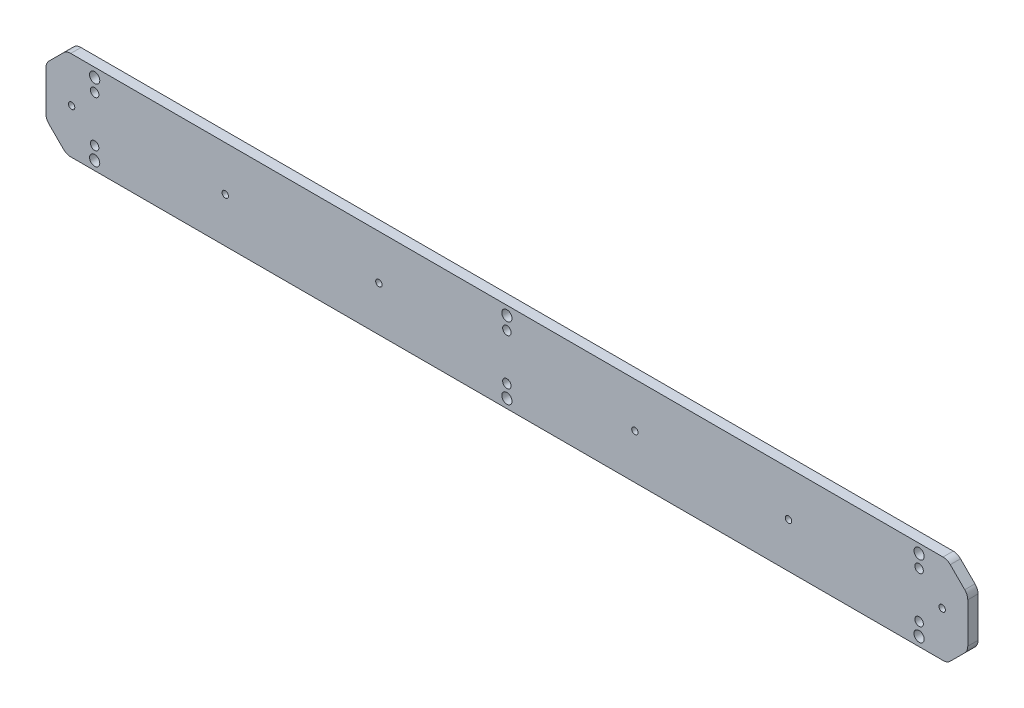
ISO-10303-21;
HEADER;
FILE_DESCRIPTION(('STEP AP214'),'2;1');
FILE_NAME('part.step','',(''),(''),'','','');
FILE_SCHEMA(('AUTOMOTIVE_DESIGN { 1 0 10303 214 1 1 1 1 }'));
ENDSEC;
DATA;
#1=APPLICATION_CONTEXT('core data for automotive mechanical design processes');
#2=APPLICATION_PROTOCOL_DEFINITION('international standard','automotive_design',2000,#1);
#3=PRODUCT_CONTEXT('',#1,'mechanical');
#4=PRODUCT('Part','Part','',(#3));
#5=PRODUCT_RELATED_PRODUCT_CATEGORY('part','',(#4));
#6=PRODUCT_DEFINITION_FORMATION('','',#4);
#7=PRODUCT_DEFINITION_CONTEXT('part definition',#1,'design');
#8=PRODUCT_DEFINITION('design','',#6,#7);
#9=PRODUCT_DEFINITION_SHAPE('','',#8);
#10=(LENGTH_UNIT() NAMED_UNIT(*) SI_UNIT(.MILLI.,.METRE.));
#11=(NAMED_UNIT(*) PLANE_ANGLE_UNIT() SI_UNIT($,.RADIAN.));
#12=(NAMED_UNIT(*) SI_UNIT($,.STERADIAN.) SOLID_ANGLE_UNIT());
#13=UNCERTAINTY_MEASURE_WITH_UNIT(LENGTH_MEASURE(1.E-05),#10,'distance_accuracy_value','');
#14=(GEOMETRIC_REPRESENTATION_CONTEXT(3) GLOBAL_UNCERTAINTY_ASSIGNED_CONTEXT((#13)) GLOBAL_UNIT_ASSIGNED_CONTEXT((#10,
#11,#12)) REPRESENTATION_CONTEXT('',''));
#15=CARTESIAN_POINT('',(0.,0.,0.));
#16=DIRECTION('',(0.,0.,1.));
#17=DIRECTION('',(1.,0.,0.));
#18=AXIS2_PLACEMENT_3D('',#15,#16,#17);
#19=CARTESIAN_POINT('',(0.,0.,0.));
#20=DIRECTION('',(0.,0.,-1.));
#21=DIRECTION('',(-1.,0.,0.));
#22=AXIS2_PLACEMENT_3D('',#19,#20,#21);
#23=PLANE('',#22);
#24=CARTESIAN_POINT('',(-170.,0.,0.));
#25=DIRECTION('',(0.,0.,1.));
#26=DIRECTION('',(1.,0.,0.));
#27=AXIS2_PLACEMENT_3D('',#24,#25,#26);
#28=CIRCLE('',#27,1.25);
#29=CARTESIAN_POINT('',(-168.75,0.,0.));
#30=VERTEX_POINT('',#29);
#31=EDGE_CURVE('E405',#30,#30,#28,.T.);
#32=ORIENTED_EDGE('',*,*,#31,.T.);
#33=EDGE_LOOP('',(#32));
#34=FACE_BOUND('',#33,.T.);
#35=CARTESIAN_POINT('',(-110.,0.,0.));
#36=DIRECTION('',(0.,0.,1.));
#37=DIRECTION('',(1.,0.,0.));
#38=AXIS2_PLACEMENT_3D('',#35,#36,#37);
#39=CIRCLE('',#38,1.25);
#40=CARTESIAN_POINT('',(-108.75,0.,0.));
#41=VERTEX_POINT('',#40);
#42=EDGE_CURVE('E399',#41,#41,#39,.T.);
#43=ORIENTED_EDGE('',*,*,#42,.T.);
#44=EDGE_LOOP('',(#43));
#45=FACE_BOUND('',#44,.T.);
#46=CARTESIAN_POINT('',(-50.,0.,0.));
#47=DIRECTION('',(0.,0.,1.));
#48=DIRECTION('',(1.,0.,0.));
#49=AXIS2_PLACEMENT_3D('',#46,#47,#48);
#50=CIRCLE('',#49,1.25);
#51=CARTESIAN_POINT('',(-48.75,0.,0.));
#52=VERTEX_POINT('',#51);
#53=EDGE_CURVE('E393',#52,#52,#50,.T.);
#54=ORIENTED_EDGE('',*,*,#53,.T.);
#55=EDGE_LOOP('',(#54));
#56=FACE_BOUND('',#55,.T.);
#57=CARTESIAN_POINT('',(50.,0.,0.));
#58=DIRECTION('',(0.,0.,1.));
#59=DIRECTION('',(1.,0.,0.));
#60=AXIS2_PLACEMENT_3D('',#57,#58,#59);
#61=CIRCLE('',#60,1.25);
#62=CARTESIAN_POINT('',(51.25,0.,0.));
#63=VERTEX_POINT('',#62);
#64=EDGE_CURVE('E387',#63,#63,#61,.T.);
#65=ORIENTED_EDGE('',*,*,#64,.T.);
#66=EDGE_LOOP('',(#65));
#67=FACE_BOUND('',#66,.T.);
#68=CARTESIAN_POINT('',(110.,0.,0.));
#69=DIRECTION('',(0.,0.,1.));
#70=DIRECTION('',(1.,0.,0.));
#71=AXIS2_PLACEMENT_3D('',#68,#69,#70);
#72=CIRCLE('',#71,1.25);
#73=CARTESIAN_POINT('',(111.25,0.,0.));
#74=VERTEX_POINT('',#73);
#75=EDGE_CURVE('E381',#74,#74,#72,.T.);
#76=ORIENTED_EDGE('',*,*,#75,.T.);
#77=EDGE_LOOP('',(#76));
#78=FACE_BOUND('',#77,.T.);
#79=CARTESIAN_POINT('',(170.,0.,0.));
#80=DIRECTION('',(0.,0.,1.));
#81=DIRECTION('',(1.,0.,0.));
#82=AXIS2_PLACEMENT_3D('',#79,#80,#81);
#83=CIRCLE('',#82,1.25);
#84=CARTESIAN_POINT('',(171.25,0.,0.));
#85=VERTEX_POINT('',#84);
#86=EDGE_CURVE('E375',#85,#85,#83,.T.);
#87=ORIENTED_EDGE('',*,*,#86,.T.);
#88=EDGE_LOOP('',(#87));
#89=FACE_BOUND('',#88,.T.);
#90=CARTESIAN_POINT('',(0.,9.,0.));
#91=DIRECTION('',(0.,0.,1.));
#92=DIRECTION('',(1.,0.,0.));
#93=AXIS2_PLACEMENT_3D('',#90,#91,#92);
#94=CIRCLE('',#93,1.65);
#95=CARTESIAN_POINT('',(1.65,9.,0.));
#96=VERTEX_POINT('',#95);
#97=EDGE_CURVE('E357',#96,#96,#94,.T.);
#98=ORIENTED_EDGE('',*,*,#97,.T.);
#99=EDGE_LOOP('',(#98));
#100=FACE_BOUND('',#99,.T.);
#101=CARTESIAN_POINT('',(0.,-9.,0.));
#102=DIRECTION('',(0.,0.,1.));
#103=DIRECTION('',(1.,0.,0.));
#104=AXIS2_PLACEMENT_3D('',#101,#102,#103);
#105=CIRCLE('',#104,1.65);
#106=CARTESIAN_POINT('',(1.65,-9.,0.));
#107=VERTEX_POINT('',#106);
#108=EDGE_CURVE('E351',#107,#107,#105,.T.);
#109=ORIENTED_EDGE('',*,*,#108,.T.);
#110=EDGE_LOOP('',(#109));
#111=FACE_BOUND('',#110,.T.);
#112=DIRECTION('',(1.,0.,0.));
#113=VECTOR('',#112,1.);
#114=CARTESIAN_POINT('',(-180.,-17.5,0.));
#115=LINE('',#114,#113);
#116=CARTESIAN_POINT('',(-170.343145750508,-17.5,0.));
#117=VERTEX_POINT('',#116);
#118=CARTESIAN_POINT('',(170.343145750507,-17.5,0.));
#119=VERTEX_POINT('',#118);
#120=EDGE_CURVE('E181',#117,#119,#115,.T.);
#121=ORIENTED_EDGE('',*,*,#120,.F.);
#122=CARTESIAN_POINT('',(-170.343145750508,-13.5,0.));
#123=DIRECTION('',(0.,0.,-1.));
#124=DIRECTION('',(-1.,0.,0.));
#125=AXIS2_PLACEMENT_3D('',#122,#123,#124);
#126=CIRCLE('',#125,4.);
#127=CARTESIAN_POINT('',(-173.171572875254,-16.3284271247462,0.));
#128=VERTEX_POINT('',#127);
#129=EDGE_CURVE('E163',#117,#128,#126,.T.);
#130=ORIENTED_EDGE('',*,*,#129,.T.);
#131=DIRECTION('',(0.707106781186548,-0.707106781186548,0.));
#132=VECTOR('',#131,1.);
#133=CARTESIAN_POINT('',(-94.75,-94.75,0.));
#134=LINE('',#133,#132);
#135=CARTESIAN_POINT('',(-178.828427124746,-10.6715728752538,0.));
#136=VERTEX_POINT('',#135);
#137=EDGE_CURVE('E231',#128,#136,#134,.F.);
#138=ORIENTED_EDGE('',*,*,#137,.T.);
#139=CARTESIAN_POINT('',(-176.,-7.84314575050758,0.));
#140=DIRECTION('',(0.,0.,-1.));
#141=DIRECTION('',(-1.,0.,0.));
#142=AXIS2_PLACEMENT_3D('',#139,#140,#141);
#143=CIRCLE('',#142,4.);
#144=CARTESIAN_POINT('',(-180.,-7.84314575050758,0.));
#145=VERTEX_POINT('',#144);
#146=EDGE_CURVE('E174',#136,#145,#143,.T.);
#147=ORIENTED_EDGE('',*,*,#146,.T.);
#148=DIRECTION('',(0.,-1.,0.));
#149=VECTOR('',#148,1.);
#150=CARTESIAN_POINT('',(-180.,-17.5,0.));
#151=LINE('',#150,#149);
#152=CARTESIAN_POINT('',(-180.,7.84314575050757,0.));
#153=VERTEX_POINT('',#152);
#154=EDGE_CURVE('E193',#153,#145,#151,.T.);
#155=ORIENTED_EDGE('',*,*,#154,.F.);
#156=CARTESIAN_POINT('',(-176.,7.84314575050757,0.));
#157=DIRECTION('',(0.,0.,-1.));
#158=DIRECTION('',(-1.,0.,0.));
#159=AXIS2_PLACEMENT_3D('',#156,#157,#158);
#160=CIRCLE('',#159,4.);
#161=CARTESIAN_POINT('',(-178.828427124746,10.6715728752538,0.));
#162=VERTEX_POINT('',#161);
#163=EDGE_CURVE('E258',#153,#162,#160,.T.);
#164=ORIENTED_EDGE('',*,*,#163,.T.);
#165=DIRECTION('',(-0.707106781186548,-0.707106781186548,0.));
#166=VECTOR('',#165,1.);
#167=CARTESIAN_POINT('',(-94.75,94.75,0.));
#168=LINE('',#167,#166);
#169=CARTESIAN_POINT('',(-173.171572875254,16.3284271247462,0.));
#170=VERTEX_POINT('',#169);
#171=EDGE_CURVE('E228',#162,#170,#168,.F.);
#172=ORIENTED_EDGE('',*,*,#171,.T.);
#173=CARTESIAN_POINT('',(-170.343145750508,13.5,0.));
#174=DIRECTION('',(0.,0.,-1.));
#175=DIRECTION('',(-1.,0.,0.));
#176=AXIS2_PLACEMENT_3D('',#173,#174,#175);
#177=CIRCLE('',#176,4.);
#178=CARTESIAN_POINT('',(-170.343145750508,17.5,0.));
#179=VERTEX_POINT('',#178);
#180=EDGE_CURVE('E256',#170,#179,#177,.T.);
#181=ORIENTED_EDGE('',*,*,#180,.T.);
#182=DIRECTION('',(-1.,0.,0.));
#183=VECTOR('',#182,1.);
#184=CARTESIAN_POINT('',(-180.,17.5,0.));
#185=LINE('',#184,#183);
#186=CARTESIAN_POINT('',(170.343145750507,17.5,0.));
#187=VERTEX_POINT('',#186);
#188=EDGE_CURVE('E199',#187,#179,#185,.T.);
#189=ORIENTED_EDGE('',*,*,#188,.F.);
#190=CARTESIAN_POINT('',(170.343145750508,13.5,0.));
#191=DIRECTION('',(0.,0.,-1.));
#192=DIRECTION('',(-1.,0.,0.));
#193=AXIS2_PLACEMENT_3D('',#190,#191,#192);
#194=CIRCLE('',#193,4.);
#195=CARTESIAN_POINT('',(173.171572875254,16.3284271247462,0.));
#196=VERTEX_POINT('',#195);
#197=EDGE_CURVE('E185',#187,#196,#194,.T.);
#198=ORIENTED_EDGE('',*,*,#197,.T.);
#199=DIRECTION('',(-0.707106781186548,0.707106781186548,0.));
#200=VECTOR('',#199,1.);
#201=CARTESIAN_POINT('',(94.75,94.75,0.));
#202=LINE('',#201,#200);
#203=CARTESIAN_POINT('',(178.828427124746,10.6715728752538,0.));
#204=VERTEX_POINT('',#203);
#205=EDGE_CURVE('E233',#196,#204,#202,.F.);
#206=ORIENTED_EDGE('',*,*,#205,.T.);
#207=CARTESIAN_POINT('',(176.,7.84314575050757,0.));
#208=DIRECTION('',(0.,0.,-1.));
#209=DIRECTION('',(-1.,0.,0.));
#210=AXIS2_PLACEMENT_3D('',#207,#208,#209);
#211=CIRCLE('',#210,4.);
#212=CARTESIAN_POINT('',(180.,7.84314575050757,0.));
#213=VERTEX_POINT('',#212);
#214=EDGE_CURVE('E251',#204,#213,#211,.T.);
#215=ORIENTED_EDGE('',*,*,#214,.T.);
#216=DIRECTION('',(0.,1.,0.));
#217=VECTOR('',#216,1.);
#218=CARTESIAN_POINT('',(180.,-17.5,0.));
#219=LINE('',#218,#217);
#220=CARTESIAN_POINT('',(180.,-7.84314575050758,0.));
#221=VERTEX_POINT('',#220);
#222=EDGE_CURVE('E206',#221,#213,#219,.T.);
#223=ORIENTED_EDGE('',*,*,#222,.F.);
#224=CARTESIAN_POINT('',(176.,-7.84314575050758,0.));
#225=DIRECTION('',(0.,0.,-1.));
#226=DIRECTION('',(-1.,0.,0.));
#227=AXIS2_PLACEMENT_3D('',#224,#225,#226);
#228=CIRCLE('',#227,4.);
#229=CARTESIAN_POINT('',(178.828427124746,-10.6715728752538,0.));
#230=VERTEX_POINT('',#229);
#231=EDGE_CURVE('E253',#221,#230,#228,.T.);
#232=ORIENTED_EDGE('',*,*,#231,.T.);
#233=DIRECTION('',(0.707106781186548,0.707106781186548,0.));
#234=VECTOR('',#233,1.);
#235=CARTESIAN_POINT('',(94.75,-94.75,0.));
#236=LINE('',#235,#234);
#237=CARTESIAN_POINT('',(173.171572875254,-16.3284271247462,0.));
#238=VERTEX_POINT('',#237);
#239=EDGE_CURVE('E236',#230,#238,#236,.F.);
#240=ORIENTED_EDGE('',*,*,#239,.T.);
#241=CARTESIAN_POINT('',(170.343145750508,-13.5,0.));
#242=DIRECTION('',(0.,0.,-1.));
#243=DIRECTION('',(-1.,0.,0.));
#244=AXIS2_PLACEMENT_3D('',#241,#242,#243);
#245=CIRCLE('',#244,4.);
#246=EDGE_CURVE('E191',#238,#119,#245,.T.);
#247=ORIENTED_EDGE('',*,*,#246,.T.);
#248=EDGE_LOOP('',(#121,#130,#138,#147,#155,#164,#172,#181,#189,#198,#206,#215,#223,#232,#240,#247));
#249=FACE_BOUND('',#248,.T.);
#250=CARTESIAN_POINT('',(0.,14.,0.));
#251=DIRECTION('',(0.,0.,-1.));
#252=DIRECTION('',(-1.,0.,0.));
#253=AXIS2_PLACEMENT_3D('',#250,#251,#252);
#254=CIRCLE('',#253,2.);
#255=CARTESIAN_POINT('',(-2.,14.,0.));
#256=VERTEX_POINT('',#255);
#257=EDGE_CURVE('E203',#256,#256,#254,.T.);
#258=ORIENTED_EDGE('',*,*,#257,.F.);
#259=EDGE_LOOP('',(#258));
#260=FACE_BOUND('',#259,.T.);
#261=CARTESIAN_POINT('',(0.,-14.,0.));
#262=DIRECTION('',(0.,0.,-1.));
#263=DIRECTION('',(-1.,0.,0.));
#264=AXIS2_PLACEMENT_3D('',#261,#262,#263);
#265=CIRCLE('',#264,2.);
#266=CARTESIAN_POINT('',(-2.,-14.,0.));
#267=VERTEX_POINT('',#266);
#268=EDGE_CURVE('E208',#267,#267,#265,.T.);
#269=ORIENTED_EDGE('',*,*,#268,.F.);
#270=EDGE_LOOP('',(#269));
#271=FACE_BOUND('',#270,.T.);
#272=CARTESIAN_POINT('',(161.,14.,0.));
#273=DIRECTION('',(0.,0.,-1.));
#274=DIRECTION('',(-1.,0.,0.));
#275=AXIS2_PLACEMENT_3D('',#272,#273,#274);
#276=CIRCLE('',#275,2.);
#277=CARTESIAN_POINT('',(159.,14.,0.));
#278=VERTEX_POINT('',#277);
#279=EDGE_CURVE('E212',#278,#278,#276,.T.);
#280=ORIENTED_EDGE('',*,*,#279,.F.);
#281=EDGE_LOOP('',(#280));
#282=FACE_BOUND('',#281,.T.);
#283=CARTESIAN_POINT('',(161.,-14.,0.));
#284=DIRECTION('',(0.,0.,-1.));
#285=DIRECTION('',(-1.,0.,0.));
#286=AXIS2_PLACEMENT_3D('',#283,#284,#285);
#287=CIRCLE('',#286,2.);
#288=CARTESIAN_POINT('',(159.,-14.,0.));
#289=VERTEX_POINT('',#288);
#290=EDGE_CURVE('E216',#289,#289,#287,.T.);
#291=ORIENTED_EDGE('',*,*,#290,.F.);
#292=EDGE_LOOP('',(#291));
#293=FACE_BOUND('',#292,.T.);
#294=CARTESIAN_POINT('',(-161.,14.,0.));
#295=DIRECTION('',(0.,0.,-1.));
#296=DIRECTION('',(-1.,0.,0.));
#297=AXIS2_PLACEMENT_3D('',#294,#295,#296);
#298=CIRCLE('',#297,2.);
#299=CARTESIAN_POINT('',(-163.,14.,0.));
#300=VERTEX_POINT('',#299);
#301=EDGE_CURVE('E220',#300,#300,#298,.T.);
#302=ORIENTED_EDGE('',*,*,#301,.F.);
#303=EDGE_LOOP('',(#302));
#304=FACE_BOUND('',#303,.T.);
#305=CARTESIAN_POINT('',(-161.,-14.,0.));
#306=DIRECTION('',(0.,0.,-1.));
#307=DIRECTION('',(-1.,0.,0.));
#308=AXIS2_PLACEMENT_3D('',#305,#306,#307);
#309=CIRCLE('',#308,2.);
#310=CARTESIAN_POINT('',(-163.,-14.,0.));
#311=VERTEX_POINT('',#310);
#312=EDGE_CURVE('E224',#311,#311,#309,.T.);
#313=ORIENTED_EDGE('',*,*,#312,.F.);
#314=EDGE_LOOP('',(#313));
#315=FACE_BOUND('',#314,.T.);
#316=CARTESIAN_POINT('',(161.,-9.,0.));
#317=DIRECTION('',(0.,0.,1.));
#318=DIRECTION('',(1.,0.,0.));
#319=AXIS2_PLACEMENT_3D('',#316,#317,#318);
#320=CIRCLE('',#319,1.65000000000001);
#321=CARTESIAN_POINT('',(162.65,-9.,0.));
#322=VERTEX_POINT('',#321);
#323=EDGE_CURVE('E339',#322,#322,#320,.T.);
#324=ORIENTED_EDGE('',*,*,#323,.T.);
#325=EDGE_LOOP('',(#324));
#326=FACE_BOUND('',#325,.T.);
#327=CARTESIAN_POINT('',(161.,9.,0.));
#328=DIRECTION('',(0.,0.,1.));
#329=DIRECTION('',(1.,0.,0.));
#330=AXIS2_PLACEMENT_3D('',#327,#328,#329);
#331=CIRCLE('',#330,1.65000000000001);
#332=CARTESIAN_POINT('',(162.65,9.,0.));
#333=VERTEX_POINT('',#332);
#334=EDGE_CURVE('E345',#333,#333,#331,.T.);
#335=ORIENTED_EDGE('',*,*,#334,.T.);
#336=EDGE_LOOP('',(#335));
#337=FACE_BOUND('',#336,.T.);
#338=CARTESIAN_POINT('',(-161.,-9.,0.));
#339=DIRECTION('',(0.,0.,1.));
#340=DIRECTION('',(1.,0.,0.));
#341=AXIS2_PLACEMENT_3D('',#338,#339,#340);
#342=CIRCLE('',#341,1.65000000000001);
#343=CARTESIAN_POINT('',(-159.35,-9.,0.));
#344=VERTEX_POINT('',#343);
#345=EDGE_CURVE('E363',#344,#344,#342,.T.);
#346=ORIENTED_EDGE('',*,*,#345,.T.);
#347=EDGE_LOOP('',(#346));
#348=FACE_BOUND('',#347,.T.);
#349=CARTESIAN_POINT('',(-161.,9.,0.));
#350=DIRECTION('',(0.,0.,1.));
#351=DIRECTION('',(1.,0.,0.));
#352=AXIS2_PLACEMENT_3D('',#349,#350,#351);
#353=CIRCLE('',#352,1.65000000000001);
#354=CARTESIAN_POINT('',(-159.35,9.,0.));
#355=VERTEX_POINT('',#354);
#356=EDGE_CURVE('E369',#355,#355,#353,.T.);
#357=ORIENTED_EDGE('',*,*,#356,.T.);
#358=EDGE_LOOP('',(#357));
#359=FACE_BOUND('',#358,.T.);
#360=ADVANCED_FACE('F48',(#34,#45,#56,#67,#78,#89,#100,#111,#249,#260,#271,#282,#293,#304,#315,
#326,#337,#348,#359),#23,.T.);
#361=CARTESIAN_POINT('',(0.,0.,4.));
#362=DIRECTION('',(0.,0.,-1.));
#363=DIRECTION('',(-1.,0.,0.));
#364=AXIS2_PLACEMENT_3D('',#361,#362,#363);
#365=PLANE('',#364);
#366=CARTESIAN_POINT('',(-170.,0.,4.));
#367=DIRECTION('',(0.,0.,1.));
#368=DIRECTION('',(1.,0.,0.));
#369=AXIS2_PLACEMENT_3D('',#366,#367,#368);
#370=CIRCLE('',#369,1.25);
#371=CARTESIAN_POINT('',(-168.75,0.,4.));
#372=VERTEX_POINT('',#371);
#373=EDGE_CURVE('E408',#372,#372,#370,.T.);
#374=ORIENTED_EDGE('',*,*,#373,.F.);
#375=EDGE_LOOP('',(#374));
#376=FACE_BOUND('',#375,.T.);
#377=CARTESIAN_POINT('',(-110.,0.,4.));
#378=DIRECTION('',(0.,0.,1.));
#379=DIRECTION('',(1.,0.,0.));
#380=AXIS2_PLACEMENT_3D('',#377,#378,#379);
#381=CIRCLE('',#380,1.25);
#382=CARTESIAN_POINT('',(-108.75,0.,4.));
#383=VERTEX_POINT('',#382);
#384=EDGE_CURVE('E402',#383,#383,#381,.T.);
#385=ORIENTED_EDGE('',*,*,#384,.F.);
#386=EDGE_LOOP('',(#385));
#387=FACE_BOUND('',#386,.T.);
#388=CARTESIAN_POINT('',(-50.,0.,4.));
#389=DIRECTION('',(0.,0.,1.));
#390=DIRECTION('',(1.,0.,0.));
#391=AXIS2_PLACEMENT_3D('',#388,#389,#390);
#392=CIRCLE('',#391,1.25);
#393=CARTESIAN_POINT('',(-48.75,0.,4.));
#394=VERTEX_POINT('',#393);
#395=EDGE_CURVE('E396',#394,#394,#392,.T.);
#396=ORIENTED_EDGE('',*,*,#395,.F.);
#397=EDGE_LOOP('',(#396));
#398=FACE_BOUND('',#397,.T.);
#399=CARTESIAN_POINT('',(50.,0.,4.));
#400=DIRECTION('',(0.,0.,1.));
#401=DIRECTION('',(1.,0.,0.));
#402=AXIS2_PLACEMENT_3D('',#399,#400,#401);
#403=CIRCLE('',#402,1.25);
#404=CARTESIAN_POINT('',(51.25,0.,4.));
#405=VERTEX_POINT('',#404);
#406=EDGE_CURVE('E390',#405,#405,#403,.T.);
#407=ORIENTED_EDGE('',*,*,#406,.F.);
#408=EDGE_LOOP('',(#407));
#409=FACE_BOUND('',#408,.T.);
#410=CARTESIAN_POINT('',(110.,0.,4.));
#411=DIRECTION('',(0.,0.,1.));
#412=DIRECTION('',(1.,0.,0.));
#413=AXIS2_PLACEMENT_3D('',#410,#411,#412);
#414=CIRCLE('',#413,1.25);
#415=CARTESIAN_POINT('',(111.25,0.,4.));
#416=VERTEX_POINT('',#415);
#417=EDGE_CURVE('E384',#416,#416,#414,.T.);
#418=ORIENTED_EDGE('',*,*,#417,.F.);
#419=EDGE_LOOP('',(#418));
#420=FACE_BOUND('',#419,.T.);
#421=CARTESIAN_POINT('',(170.,0.,4.));
#422=DIRECTION('',(0.,0.,1.));
#423=DIRECTION('',(1.,0.,0.));
#424=AXIS2_PLACEMENT_3D('',#421,#422,#423);
#425=CIRCLE('',#424,1.25);
#426=CARTESIAN_POINT('',(171.25,0.,4.));
#427=VERTEX_POINT('',#426);
#428=EDGE_CURVE('E378',#427,#427,#425,.T.);
#429=ORIENTED_EDGE('',*,*,#428,.F.);
#430=EDGE_LOOP('',(#429));
#431=FACE_BOUND('',#430,.T.);
#432=CARTESIAN_POINT('',(-161.,9.,4.));
#433=DIRECTION('',(0.,0.,1.));
#434=DIRECTION('',(1.,0.,0.));
#435=AXIS2_PLACEMENT_3D('',#432,#433,#434);
#436=CIRCLE('',#435,1.65000000000001);
#437=CARTESIAN_POINT('',(-159.35,9.,4.));
#438=VERTEX_POINT('',#437);
#439=EDGE_CURVE('E372',#438,#438,#436,.T.);
#440=ORIENTED_EDGE('',*,*,#439,.F.);
#441=EDGE_LOOP('',(#440));
#442=FACE_BOUND('',#441,.T.);
#443=CARTESIAN_POINT('',(0.,9.,4.));
#444=DIRECTION('',(0.,0.,1.));
#445=DIRECTION('',(1.,0.,0.));
#446=AXIS2_PLACEMENT_3D('',#443,#444,#445);
#447=CIRCLE('',#446,1.65);
#448=CARTESIAN_POINT('',(1.65,9.,4.));
#449=VERTEX_POINT('',#448);
#450=EDGE_CURVE('E360',#449,#449,#447,.T.);
#451=ORIENTED_EDGE('',*,*,#450,.F.);
#452=EDGE_LOOP('',(#451));
#453=FACE_BOUND('',#452,.T.);
#454=CARTESIAN_POINT('',(161.,9.,4.));
#455=DIRECTION('',(0.,0.,1.));
#456=DIRECTION('',(1.,0.,0.));
#457=AXIS2_PLACEMENT_3D('',#454,#455,#456);
#458=CIRCLE('',#457,1.65000000000001);
#459=CARTESIAN_POINT('',(162.65,9.,4.));
#460=VERTEX_POINT('',#459);
#461=EDGE_CURVE('E348',#460,#460,#458,.T.);
#462=ORIENTED_EDGE('',*,*,#461,.F.);
#463=EDGE_LOOP('',(#462));
#464=FACE_BOUND('',#463,.T.);
#465=CARTESIAN_POINT('',(161.,-9.,4.));
#466=DIRECTION('',(0.,0.,1.));
#467=DIRECTION('',(1.,0.,0.));
#468=AXIS2_PLACEMENT_3D('',#465,#466,#467);
#469=CIRCLE('',#468,1.65000000000001);
#470=CARTESIAN_POINT('',(162.65,-9.,4.));
#471=VERTEX_POINT('',#470);
#472=EDGE_CURVE('E342',#471,#471,#469,.T.);
#473=ORIENTED_EDGE('',*,*,#472,.F.);
#474=EDGE_LOOP('',(#473));
#475=FACE_BOUND('',#474,.T.);
#476=CARTESIAN_POINT('',(-161.,-14.,4.));
#477=DIRECTION('',(0.,0.,1.));
#478=DIRECTION('',(1.,0.,0.));
#479=AXIS2_PLACEMENT_3D('',#476,#477,#478);
#480=CIRCLE('',#479,2.);
#481=CARTESIAN_POINT('',(-159.,-14.,4.));
#482=VERTEX_POINT('',#481);
#483=EDGE_CURVE('E227',#482,#482,#480,.T.);
#484=ORIENTED_EDGE('',*,*,#483,.F.);
#485=EDGE_LOOP('',(#484));
#486=FACE_BOUND('',#485,.T.);
#487=CARTESIAN_POINT('',(-161.,14.,4.));
#488=DIRECTION('',(0.,0.,1.));
#489=DIRECTION('',(1.,0.,0.));
#490=AXIS2_PLACEMENT_3D('',#487,#488,#489);
#491=CIRCLE('',#490,2.);
#492=CARTESIAN_POINT('',(-159.,14.,4.));
#493=VERTEX_POINT('',#492);
#494=EDGE_CURVE('E223',#493,#493,#491,.T.);
#495=ORIENTED_EDGE('',*,*,#494,.F.);
#496=EDGE_LOOP('',(#495));
#497=FACE_BOUND('',#496,.T.);
#498=CARTESIAN_POINT('',(161.,-14.,4.));
#499=DIRECTION('',(0.,0.,1.));
#500=DIRECTION('',(1.,0.,0.));
#501=AXIS2_PLACEMENT_3D('',#498,#499,#500);
#502=CIRCLE('',#501,2.);
#503=CARTESIAN_POINT('',(163.,-14.,4.));
#504=VERTEX_POINT('',#503);
#505=EDGE_CURVE('E219',#504,#504,#502,.T.);
#506=ORIENTED_EDGE('',*,*,#505,.F.);
#507=EDGE_LOOP('',(#506));
#508=FACE_BOUND('',#507,.T.);
#509=CARTESIAN_POINT('',(161.,14.,4.));
#510=DIRECTION('',(0.,0.,1.));
#511=DIRECTION('',(1.,0.,0.));
#512=AXIS2_PLACEMENT_3D('',#509,#510,#511);
#513=CIRCLE('',#512,2.);
#514=CARTESIAN_POINT('',(163.,14.,4.));
#515=VERTEX_POINT('',#514);
#516=EDGE_CURVE('E215',#515,#515,#513,.T.);
#517=ORIENTED_EDGE('',*,*,#516,.F.);
#518=EDGE_LOOP('',(#517));
#519=FACE_BOUND('',#518,.T.);
#520=CARTESIAN_POINT('',(0.,-14.,4.));
#521=DIRECTION('',(0.,0.,1.));
#522=DIRECTION('',(1.,0.,0.));
#523=AXIS2_PLACEMENT_3D('',#520,#521,#522);
#524=CIRCLE('',#523,2.);
#525=CARTESIAN_POINT('',(2.,-14.,4.));
#526=VERTEX_POINT('',#525);
#527=EDGE_CURVE('E211',#526,#526,#524,.T.);
#528=ORIENTED_EDGE('',*,*,#527,.F.);
#529=EDGE_LOOP('',(#528));
#530=FACE_BOUND('',#529,.T.);
#531=CARTESIAN_POINT('',(0.,14.,4.));
#532=DIRECTION('',(0.,0.,1.));
#533=DIRECTION('',(1.,0.,0.));
#534=AXIS2_PLACEMENT_3D('',#531,#532,#533);
#535=CIRCLE('',#534,2.);
#536=CARTESIAN_POINT('',(2.,14.,4.));
#537=VERTEX_POINT('',#536);
#538=EDGE_CURVE('E207',#537,#537,#535,.T.);
#539=ORIENTED_EDGE('',*,*,#538,.F.);
#540=EDGE_LOOP('',(#539));
#541=FACE_BOUND('',#540,.T.);
#542=DIRECTION('',(-0.707106781186548,0.707106781186548,0.));
#543=VECTOR('',#542,1.);
#544=CARTESIAN_POINT('',(-172.,-17.5,4.));
#545=LINE('',#544,#543);
#546=CARTESIAN_POINT('',(-178.828427124746,-10.6715728752538,4.));
#547=VERTEX_POINT('',#546);
#548=CARTESIAN_POINT('',(-173.171572875254,-16.3284271247462,4.));
#549=VERTEX_POINT('',#548);
#550=EDGE_CURVE('E240',#547,#549,#545,.F.);
#551=ORIENTED_EDGE('',*,*,#550,.T.);
#552=CARTESIAN_POINT('',(-170.343145750508,-13.5,4.));
#553=DIRECTION('',(0.,0.,-1.));
#554=DIRECTION('',(-1.,0.,0.));
#555=AXIS2_PLACEMENT_3D('',#552,#553,#554);
#556=CIRCLE('',#555,4.);
#557=CARTESIAN_POINT('',(-170.343145750508,-17.5,4.));
#558=VERTEX_POINT('',#557);
#559=EDGE_CURVE('E275',#549,#558,#556,.F.);
#560=ORIENTED_EDGE('',*,*,#559,.T.);
#561=DIRECTION('',(1.,0.,0.));
#562=VECTOR('',#561,1.);
#563=CARTESIAN_POINT('',(-180.,-17.5,4.));
#564=LINE('',#563,#562);
#565=CARTESIAN_POINT('',(170.343145750507,-17.5,4.));
#566=VERTEX_POINT('',#565);
#567=EDGE_CURVE('E184',#558,#566,#564,.T.);
#568=ORIENTED_EDGE('',*,*,#567,.T.);
#569=CARTESIAN_POINT('',(170.343145750508,-13.5,4.));
#570=DIRECTION('',(0.,0.,-1.));
#571=DIRECTION('',(-1.,0.,0.));
#572=AXIS2_PLACEMENT_3D('',#569,#570,#571);
#573=CIRCLE('',#572,4.);
#574=CARTESIAN_POINT('',(173.171572875254,-16.3284271247462,4.));
#575=VERTEX_POINT('',#574);
#576=EDGE_CURVE('E269',#566,#575,#573,.F.);
#577=ORIENTED_EDGE('',*,*,#576,.T.);
#578=DIRECTION('',(-0.707106781186548,-0.707106781186548,0.));
#579=VECTOR('',#578,1.);
#580=CARTESIAN_POINT('',(180.,-9.49999999999994,4.));
#581=LINE('',#580,#579);
#582=CARTESIAN_POINT('',(178.828427124746,-10.6715728752538,4.));
#583=VERTEX_POINT('',#582);
#584=EDGE_CURVE('E246',#575,#583,#581,.F.);
#585=ORIENTED_EDGE('',*,*,#584,.T.);
#586=CARTESIAN_POINT('',(176.,-7.84314575050758,4.));
#587=DIRECTION('',(0.,0.,-1.));
#588=DIRECTION('',(-1.,0.,0.));
#589=AXIS2_PLACEMENT_3D('',#586,#587,#588);
#590=CIRCLE('',#589,4.);
#591=CARTESIAN_POINT('',(180.,-7.84314575050758,4.));
#592=VERTEX_POINT('',#591);
#593=EDGE_CURVE('E267',#583,#592,#590,.F.);
#594=ORIENTED_EDGE('',*,*,#593,.T.);
#595=DIRECTION('',(0.,1.,0.));
#596=VECTOR('',#595,1.);
#597=CARTESIAN_POINT('',(180.,-17.5,4.));
#598=LINE('',#597,#596);
#599=CARTESIAN_POINT('',(180.,7.84314575050757,4.));
#600=VERTEX_POINT('',#599);
#601=EDGE_CURVE('E192',#592,#600,#598,.T.);
#602=ORIENTED_EDGE('',*,*,#601,.T.);
#603=CARTESIAN_POINT('',(176.,7.84314575050757,4.));
#604=DIRECTION('',(0.,0.,-1.));
#605=DIRECTION('',(-1.,0.,0.));
#606=AXIS2_PLACEMENT_3D('',#603,#604,#605);
#607=CIRCLE('',#606,4.);
#608=CARTESIAN_POINT('',(178.828427124746,10.6715728752538,4.));
#609=VERTEX_POINT('',#608);
#610=EDGE_CURVE('E265',#600,#609,#607,.F.);
#611=ORIENTED_EDGE('',*,*,#610,.T.);
#612=DIRECTION('',(0.707106781186548,-0.707106781186548,0.));
#613=VECTOR('',#612,1.);
#614=CARTESIAN_POINT('',(172.,17.5,4.));
#615=LINE('',#614,#613);
#616=CARTESIAN_POINT('',(173.171572875254,16.3284271247462,4.));
#617=VERTEX_POINT('',#616);
#618=EDGE_CURVE('E243',#609,#617,#615,.F.);
#619=ORIENTED_EDGE('',*,*,#618,.T.);
#620=CARTESIAN_POINT('',(170.343145750508,13.5,4.));
#621=DIRECTION('',(0.,0.,-1.));
#622=DIRECTION('',(-1.,0.,0.));
#623=AXIS2_PLACEMENT_3D('',#620,#621,#622);
#624=CIRCLE('',#623,4.);
#625=CARTESIAN_POINT('',(170.343145750507,17.5,4.));
#626=VERTEX_POINT('',#625);
#627=EDGE_CURVE('E263',#617,#626,#624,.F.);
#628=ORIENTED_EDGE('',*,*,#627,.T.);
#629=DIRECTION('',(-1.,0.,0.));
#630=VECTOR('',#629,1.);
#631=CARTESIAN_POINT('',(-180.,17.5,4.));
#632=LINE('',#631,#630);
#633=CARTESIAN_POINT('',(-170.343145750508,17.5,4.));
#634=VERTEX_POINT('',#633);
#635=EDGE_CURVE('E196',#626,#634,#632,.T.);
#636=ORIENTED_EDGE('',*,*,#635,.T.);
#637=CARTESIAN_POINT('',(-170.343145750508,13.5,4.));
#638=DIRECTION('',(0.,0.,-1.));
#639=DIRECTION('',(-1.,0.,0.));
#640=AXIS2_PLACEMENT_3D('',#637,#638,#639);
#641=CIRCLE('',#640,4.);
#642=CARTESIAN_POINT('',(-173.171572875254,16.3284271247462,4.));
#643=VERTEX_POINT('',#642);
#644=EDGE_CURVE('E271',#634,#643,#641,.F.);
#645=ORIENTED_EDGE('',*,*,#644,.T.);
#646=DIRECTION('',(0.707106781186548,0.707106781186548,0.));
#647=VECTOR('',#646,1.);
#648=CARTESIAN_POINT('',(-180.,9.49999999999994,4.));
#649=LINE('',#648,#647);
#650=CARTESIAN_POINT('',(-178.828427124746,10.6715728752538,4.));
#651=VERTEX_POINT('',#650);
#652=EDGE_CURVE('E238',#643,#651,#649,.F.);
#653=ORIENTED_EDGE('',*,*,#652,.T.);
#654=CARTESIAN_POINT('',(-176.,7.84314575050757,4.));
#655=DIRECTION('',(0.,0.,-1.));
#656=DIRECTION('',(-1.,0.,0.));
#657=AXIS2_PLACEMENT_3D('',#654,#655,#656);
#658=CIRCLE('',#657,4.);
#659=CARTESIAN_POINT('',(-180.,7.84314575050757,4.));
#660=VERTEX_POINT('',#659);
#661=EDGE_CURVE('E71',#651,#660,#658,.F.);
#662=ORIENTED_EDGE('',*,*,#661,.T.);
#663=DIRECTION('',(0.,-1.,0.));
#664=VECTOR('',#663,1.);
#665=CARTESIAN_POINT('',(-180.,-17.5,4.));
#666=LINE('',#665,#664);
#667=CARTESIAN_POINT('',(-180.,-7.84314575050758,4.));
#668=VERTEX_POINT('',#667);
#669=EDGE_CURVE('E324',#660,#668,#666,.T.);
#670=ORIENTED_EDGE('',*,*,#669,.T.);
#671=CARTESIAN_POINT('',(-176.,-7.84314575050758,4.));
#672=DIRECTION('',(0.,0.,-1.));
#673=DIRECTION('',(-1.,0.,0.));
#674=AXIS2_PLACEMENT_3D('',#671,#672,#673);
#675=CIRCLE('',#674,4.);
#676=EDGE_CURVE('E63',#668,#547,#675,.F.);
#677=ORIENTED_EDGE('',*,*,#676,.T.);
#678=EDGE_LOOP('',(#551,#560,#568,#577,#585,#594,#602,#611,#619,#628,#636,#645,#653,#662,#670,#677));
#679=FACE_BOUND('',#678,.T.);
#680=CARTESIAN_POINT('',(0.,-9.,4.));
#681=DIRECTION('',(0.,0.,1.));
#682=DIRECTION('',(1.,0.,0.));
#683=AXIS2_PLACEMENT_3D('',#680,#681,#682);
#684=CIRCLE('',#683,1.65);
#685=CARTESIAN_POINT('',(1.65,-9.,4.));
#686=VERTEX_POINT('',#685);
#687=EDGE_CURVE('E354',#686,#686,#684,.T.);
#688=ORIENTED_EDGE('',*,*,#687,.F.);
#689=EDGE_LOOP('',(#688));
#690=FACE_BOUND('',#689,.T.);
#691=CARTESIAN_POINT('',(-161.,-9.,4.));
#692=DIRECTION('',(0.,0.,1.));
#693=DIRECTION('',(1.,0.,0.));
#694=AXIS2_PLACEMENT_3D('',#691,#692,#693);
#695=CIRCLE('',#694,1.65000000000001);
#696=CARTESIAN_POINT('',(-159.35,-9.,4.));
#697=VERTEX_POINT('',#696);
#698=EDGE_CURVE('E366',#697,#697,#695,.T.);
#699=ORIENTED_EDGE('',*,*,#698,.F.);
#700=EDGE_LOOP('',(#699));
#701=FACE_BOUND('',#700,.T.);
#702=ADVANCED_FACE('F309',(#376,#387,#398,#409,#420,#431,#442,#453,#464,#475,#486,#497,#508,
#519,#530,#541,#679,#690,#701),#365,.F.);
#703=CARTESIAN_POINT('',(180.,-17.5,4.));
#704=DIRECTION('',(-1.,0.,0.));
#705=DIRECTION('',(0.,0.,1.));
#706=AXIS2_PLACEMENT_3D('',#703,#704,#705);
#707=PLANE('',#706);
#708=ORIENTED_EDGE('',*,*,#601,.F.);
#709=DIRECTION('',(0.,0.,1.));
#710=VECTOR('',#709,1.);
#711=CARTESIAN_POINT('',(180.,-7.84314575050758,0.));
#712=LINE('',#711,#710);
#713=EDGE_CURVE('E299',#592,#221,#712,.F.);
#714=ORIENTED_EDGE('',*,*,#713,.T.);
#715=ORIENTED_EDGE('',*,*,#222,.T.);
#716=DIRECTION('',(0.,0.,-1.));
#717=VECTOR('',#716,1.);
#718=CARTESIAN_POINT('',(180.,7.84314575050757,4.));
#719=LINE('',#718,#717);
#720=EDGE_CURVE('E296',#213,#600,#719,.F.);
#721=ORIENTED_EDGE('',*,*,#720,.T.);
#722=EDGE_LOOP('',(#708,#714,#715,#721));
#723=FACE_BOUND('',#722,.T.);
#724=ADVANCED_FACE('F416',(#723),#707,.F.);
#725=CARTESIAN_POINT('',(-180.,17.5,4.));
#726=DIRECTION('',(0.,-1.,0.));
#727=DIRECTION('',(0.,0.,-1.));
#728=AXIS2_PLACEMENT_3D('',#725,#726,#727);
#729=PLANE('',#728);
#730=ORIENTED_EDGE('',*,*,#188,.T.);
#731=DIRECTION('',(0.,0.,-1.));
#732=VECTOR('',#731,1.);
#733=CARTESIAN_POINT('',(-170.343145750508,17.5,4.));
#734=LINE('',#733,#732);
#735=EDGE_CURVE('E289',#179,#634,#734,.F.);
#736=ORIENTED_EDGE('',*,*,#735,.T.);
#737=ORIENTED_EDGE('',*,*,#635,.F.);
#738=DIRECTION('',(0.,0.,1.));
#739=VECTOR('',#738,1.);
#740=CARTESIAN_POINT('',(170.343145750508,17.5,0.));
#741=LINE('',#740,#739);
#742=EDGE_CURVE('E286',#626,#187,#741,.F.);
#743=ORIENTED_EDGE('',*,*,#742,.T.);
#744=EDGE_LOOP('',(#730,#736,#737,#743));
#745=FACE_BOUND('',#744,.T.);
#746=ADVANCED_FACE('F317',(#745),#729,.F.);
#747=CARTESIAN_POINT('',(-180.,-17.5,4.));
#748=DIRECTION('',(1.,0.,0.));
#749=DIRECTION('',(0.,0.,-1.));
#750=AXIS2_PLACEMENT_3D('',#747,#748,#749);
#751=PLANE('',#750);
#752=ORIENTED_EDGE('',*,*,#154,.T.);
#753=DIRECTION('',(0.,0.,-1.));
#754=VECTOR('',#753,1.);
#755=CARTESIAN_POINT('',(-180.,-7.84314575050758,4.));
#756=LINE('',#755,#754);
#757=EDGE_CURVE('E280',#145,#668,#756,.F.);
#758=ORIENTED_EDGE('',*,*,#757,.T.);
#759=ORIENTED_EDGE('',*,*,#669,.F.);
#760=DIRECTION('',(0.,0.,1.));
#761=VECTOR('',#760,1.);
#762=CARTESIAN_POINT('',(-180.,7.84314575050757,0.));
#763=LINE('',#762,#761);
#764=EDGE_CURVE('E277',#660,#153,#763,.F.);
#765=ORIENTED_EDGE('',*,*,#764,.T.);
#766=EDGE_LOOP('',(#752,#758,#759,#765));
#767=FACE_BOUND('',#766,.T.);
#768=ADVANCED_FACE('F460',(#767),#751,.F.);
#769=CARTESIAN_POINT('',(-180.,-17.5,4.));
#770=DIRECTION('',(0.,1.,0.));
#771=DIRECTION('',(0.,0.,1.));
#772=AXIS2_PLACEMENT_3D('',#769,#770,#771);
#773=PLANE('',#772);
#774=ORIENTED_EDGE('',*,*,#567,.F.);
#775=DIRECTION('',(0.,0.,1.));
#776=VECTOR('',#775,1.);
#777=CARTESIAN_POINT('',(-170.343145750508,-17.5,0.));
#778=LINE('',#777,#776);
#779=EDGE_CURVE('E167',#558,#117,#778,.F.);
#780=ORIENTED_EDGE('',*,*,#779,.T.);
#781=ORIENTED_EDGE('',*,*,#120,.T.);
#782=DIRECTION('',(0.,0.,-1.));
#783=VECTOR('',#782,1.);
#784=CARTESIAN_POINT('',(170.343145750508,-17.5,4.));
#785=LINE('',#784,#783);
#786=EDGE_CURVE('E186',#119,#566,#785,.F.);
#787=ORIENTED_EDGE('',*,*,#786,.T.);
#788=EDGE_LOOP('',(#774,#780,#781,#787));
#789=FACE_BOUND('',#788,.T.);
#790=ADVANCED_FACE('F179',(#789),#773,.F.);
#791=CARTESIAN_POINT('',(0.,14.,-1.));
#792=DIRECTION('',(0.,0.,1.));
#793=DIRECTION('',(1.,0.,0.));
#794=AXIS2_PLACEMENT_3D('',#791,#792,#793);
#795=CYLINDRICAL_SURFACE('',#794,2.);
#796=ORIENTED_EDGE('',*,*,#257,.T.);
#797=EDGE_LOOP('',(#796));
#798=FACE_BOUND('',#797,.T.);
#799=ORIENTED_EDGE('',*,*,#538,.T.);
#800=EDGE_LOOP('',(#799));
#801=FACE_BOUND('',#800,.T.);
#802=ADVANCED_FACE('F448',(#798,#801),#795,.F.);
#803=CARTESIAN_POINT('',(0.,-14.,-1.));
#804=DIRECTION('',(0.,0.,1.));
#805=DIRECTION('',(1.,0.,0.));
#806=AXIS2_PLACEMENT_3D('',#803,#804,#805);
#807=CYLINDRICAL_SURFACE('',#806,2.);
#808=ORIENTED_EDGE('',*,*,#268,.T.);
#809=EDGE_LOOP('',(#808));
#810=FACE_BOUND('',#809,.T.);
#811=ORIENTED_EDGE('',*,*,#527,.T.);
#812=EDGE_LOOP('',(#811));
#813=FACE_BOUND('',#812,.T.);
#814=ADVANCED_FACE('F450',(#810,#813),#807,.F.);
#815=CARTESIAN_POINT('',(161.,14.,-1.));
#816=DIRECTION('',(0.,0.,1.));
#817=DIRECTION('',(1.,0.,0.));
#818=AXIS2_PLACEMENT_3D('',#815,#816,#817);
#819=CYLINDRICAL_SURFACE('',#818,2.);
#820=ORIENTED_EDGE('',*,*,#279,.T.);
#821=EDGE_LOOP('',(#820));
#822=FACE_BOUND('',#821,.T.);
#823=ORIENTED_EDGE('',*,*,#516,.T.);
#824=EDGE_LOOP('',(#823));
#825=FACE_BOUND('',#824,.T.);
#826=ADVANCED_FACE('F457',(#822,#825),#819,.F.);
#827=CARTESIAN_POINT('',(161.,-14.,-1.));
#828=DIRECTION('',(0.,0.,1.));
#829=DIRECTION('',(1.,0.,0.));
#830=AXIS2_PLACEMENT_3D('',#827,#828,#829);
#831=CYLINDRICAL_SURFACE('',#830,2.);
#832=ORIENTED_EDGE('',*,*,#290,.T.);
#833=EDGE_LOOP('',(#832));
#834=FACE_BOUND('',#833,.T.);
#835=ORIENTED_EDGE('',*,*,#505,.T.);
#836=EDGE_LOOP('',(#835));
#837=FACE_BOUND('',#836,.T.);
#838=ADVANCED_FACE('F787',(#834,#837),#831,.F.);
#839=CARTESIAN_POINT('',(-161.,14.,-1.));
#840=DIRECTION('',(0.,0.,1.));
#841=DIRECTION('',(1.,0.,0.));
#842=AXIS2_PLACEMENT_3D('',#839,#840,#841);
#843=CYLINDRICAL_SURFACE('',#842,2.);
#844=ORIENTED_EDGE('',*,*,#301,.T.);
#845=EDGE_LOOP('',(#844));
#846=FACE_BOUND('',#845,.T.);
#847=ORIENTED_EDGE('',*,*,#494,.T.);
#848=EDGE_LOOP('',(#847));
#849=FACE_BOUND('',#848,.T.);
#850=ADVANCED_FACE('F777',(#846,#849),#843,.F.);
#851=CARTESIAN_POINT('',(-161.,-14.,-1.));
#852=DIRECTION('',(0.,0.,1.));
#853=DIRECTION('',(1.,0.,0.));
#854=AXIS2_PLACEMENT_3D('',#851,#852,#853);
#855=CYLINDRICAL_SURFACE('',#854,2.);
#856=ORIENTED_EDGE('',*,*,#312,.T.);
#857=EDGE_LOOP('',(#856));
#858=FACE_BOUND('',#857,.T.);
#859=ORIENTED_EDGE('',*,*,#483,.T.);
#860=EDGE_LOOP('',(#859));
#861=FACE_BOUND('',#860,.T.);
#862=ADVANCED_FACE('F768',(#858,#861),#855,.F.);
#863=CARTESIAN_POINT('',(161.,-9.,4.));
#864=DIRECTION('',(0.,0.,1.));
#865=DIRECTION('',(1.,0.,0.));
#866=AXIS2_PLACEMENT_3D('',#863,#864,#865);
#867=CYLINDRICAL_SURFACE('',#866,1.65000000000001);
#868=ORIENTED_EDGE('',*,*,#323,.F.);
#869=EDGE_LOOP('',(#868));
#870=FACE_BOUND('',#869,.T.);
#871=ORIENTED_EDGE('',*,*,#472,.T.);
#872=EDGE_LOOP('',(#871));
#873=FACE_BOUND('',#872,.T.);
#874=ADVANCED_FACE('F758',(#870,#873),#867,.F.);
#875=CARTESIAN_POINT('',(161.,9.,4.));
#876=DIRECTION('',(0.,0.,1.));
#877=DIRECTION('',(1.,0.,0.));
#878=AXIS2_PLACEMENT_3D('',#875,#876,#877);
#879=CYLINDRICAL_SURFACE('',#878,1.65000000000001);
#880=ORIENTED_EDGE('',*,*,#334,.F.);
#881=EDGE_LOOP('',(#880));
#882=FACE_BOUND('',#881,.T.);
#883=ORIENTED_EDGE('',*,*,#461,.T.);
#884=EDGE_LOOP('',(#883));
#885=FACE_BOUND('',#884,.T.);
#886=ADVANCED_FACE('F748',(#882,#885),#879,.F.);
#887=CARTESIAN_POINT('',(0.,-9.,4.));
#888=DIRECTION('',(0.,0.,1.));
#889=DIRECTION('',(1.,0.,0.));
#890=AXIS2_PLACEMENT_3D('',#887,#888,#889);
#891=CYLINDRICAL_SURFACE('',#890,1.65);
#892=ORIENTED_EDGE('',*,*,#108,.F.);
#893=EDGE_LOOP('',(#892));
#894=FACE_BOUND('',#893,.T.);
#895=ORIENTED_EDGE('',*,*,#687,.T.);
#896=EDGE_LOOP('',(#895));
#897=FACE_BOUND('',#896,.T.);
#898=ADVANCED_FACE('F737',(#894,#897),#891,.F.);
#899=CARTESIAN_POINT('',(0.,9.,4.));
#900=DIRECTION('',(0.,0.,1.));
#901=DIRECTION('',(1.,0.,0.));
#902=AXIS2_PLACEMENT_3D('',#899,#900,#901);
#903=CYLINDRICAL_SURFACE('',#902,1.65);
#904=ORIENTED_EDGE('',*,*,#97,.F.);
#905=EDGE_LOOP('',(#904));
#906=FACE_BOUND('',#905,.T.);
#907=ORIENTED_EDGE('',*,*,#450,.T.);
#908=EDGE_LOOP('',(#907));
#909=FACE_BOUND('',#908,.T.);
#910=ADVANCED_FACE('F725',(#906,#909),#903,.F.);
#911=CARTESIAN_POINT('',(-161.,-9.,4.));
#912=DIRECTION('',(0.,0.,1.));
#913=DIRECTION('',(1.,0.,0.));
#914=AXIS2_PLACEMENT_3D('',#911,#912,#913);
#915=CYLINDRICAL_SURFACE('',#914,1.65000000000001);
#916=ORIENTED_EDGE('',*,*,#345,.F.);
#917=EDGE_LOOP('',(#916));
#918=FACE_BOUND('',#917,.T.);
#919=ORIENTED_EDGE('',*,*,#698,.T.);
#920=EDGE_LOOP('',(#919));
#921=FACE_BOUND('',#920,.T.);
#922=ADVANCED_FACE('F714',(#918,#921),#915,.F.);
#923=CARTESIAN_POINT('',(-161.,9.,4.));
#924=DIRECTION('',(0.,0.,1.));
#925=DIRECTION('',(1.,0.,0.));
#926=AXIS2_PLACEMENT_3D('',#923,#924,#925);
#927=CYLINDRICAL_SURFACE('',#926,1.65000000000001);
#928=ORIENTED_EDGE('',*,*,#356,.F.);
#929=EDGE_LOOP('',(#928));
#930=FACE_BOUND('',#929,.T.);
#931=ORIENTED_EDGE('',*,*,#439,.T.);
#932=EDGE_LOOP('',(#931));
#933=FACE_BOUND('',#932,.T.);
#934=ADVANCED_FACE('F704',(#930,#933),#927,.F.);
#935=CARTESIAN_POINT('',(170.,0.,4.));
#936=DIRECTION('',(0.,0.,1.));
#937=DIRECTION('',(1.,0.,0.));
#938=AXIS2_PLACEMENT_3D('',#935,#936,#937);
#939=CYLINDRICAL_SURFACE('',#938,1.25);
#940=ORIENTED_EDGE('',*,*,#86,.F.);
#941=EDGE_LOOP('',(#940));
#942=FACE_BOUND('',#941,.T.);
#943=ORIENTED_EDGE('',*,*,#428,.T.);
#944=EDGE_LOOP('',(#943));
#945=FACE_BOUND('',#944,.T.);
#946=ADVANCED_FACE('F693',(#942,#945),#939,.F.);
#947=CARTESIAN_POINT('',(110.,0.,4.));
#948=DIRECTION('',(0.,0.,1.));
#949=DIRECTION('',(1.,0.,0.));
#950=AXIS2_PLACEMENT_3D('',#947,#948,#949);
#951=CYLINDRICAL_SURFACE('',#950,1.25);
#952=ORIENTED_EDGE('',*,*,#75,.F.);
#953=EDGE_LOOP('',(#952));
#954=FACE_BOUND('',#953,.T.);
#955=ORIENTED_EDGE('',*,*,#417,.T.);
#956=EDGE_LOOP('',(#955));
#957=FACE_BOUND('',#956,.T.);
#958=ADVANCED_FACE('F682',(#954,#957),#951,.F.);
#959=CARTESIAN_POINT('',(50.,0.,4.));
#960=DIRECTION('',(0.,0.,1.));
#961=DIRECTION('',(1.,0.,0.));
#962=AXIS2_PLACEMENT_3D('',#959,#960,#961);
#963=CYLINDRICAL_SURFACE('',#962,1.25);
#964=ORIENTED_EDGE('',*,*,#64,.F.);
#965=EDGE_LOOP('',(#964));
#966=FACE_BOUND('',#965,.T.);
#967=ORIENTED_EDGE('',*,*,#406,.T.);
#968=EDGE_LOOP('',(#967));
#969=FACE_BOUND('',#968,.T.);
#970=ADVANCED_FACE('F671',(#966,#969),#963,.F.);
#971=CARTESIAN_POINT('',(-50.,0.,4.));
#972=DIRECTION('',(0.,0.,1.));
#973=DIRECTION('',(1.,0.,0.));
#974=AXIS2_PLACEMENT_3D('',#971,#972,#973);
#975=CYLINDRICAL_SURFACE('',#974,1.25);
#976=ORIENTED_EDGE('',*,*,#53,.F.);
#977=EDGE_LOOP('',(#976));
#978=FACE_BOUND('',#977,.T.);
#979=ORIENTED_EDGE('',*,*,#395,.T.);
#980=EDGE_LOOP('',(#979));
#981=FACE_BOUND('',#980,.T.);
#982=ADVANCED_FACE('F660',(#978,#981),#975,.F.);
#983=CARTESIAN_POINT('',(-110.,0.,4.));
#984=DIRECTION('',(0.,0.,1.));
#985=DIRECTION('',(1.,0.,0.));
#986=AXIS2_PLACEMENT_3D('',#983,#984,#985);
#987=CYLINDRICAL_SURFACE('',#986,1.25);
#988=ORIENTED_EDGE('',*,*,#42,.F.);
#989=EDGE_LOOP('',(#988));
#990=FACE_BOUND('',#989,.T.);
#991=ORIENTED_EDGE('',*,*,#384,.T.);
#992=EDGE_LOOP('',(#991));
#993=FACE_BOUND('',#992,.T.);
#994=ADVANCED_FACE('F648',(#990,#993),#987,.F.);
#995=CARTESIAN_POINT('',(-170.,0.,4.));
#996=DIRECTION('',(0.,0.,1.));
#997=DIRECTION('',(1.,0.,0.));
#998=AXIS2_PLACEMENT_3D('',#995,#996,#997);
#999=CYLINDRICAL_SURFACE('',#998,1.25);
#1000=ORIENTED_EDGE('',*,*,#31,.F.);
#1001=EDGE_LOOP('',(#1000));
#1002=FACE_BOUND('',#1001,.T.);
#1003=ORIENTED_EDGE('',*,*,#373,.T.);
#1004=EDGE_LOOP('',(#1003));
#1005=FACE_BOUND('',#1004,.T.);
#1006=ADVANCED_FACE('F412',(#1002,#1005),#999,.F.);
#1007=CARTESIAN_POINT('',(180.,-9.49999999999994,4.));
#1008=DIRECTION('',(-0.707106781186547,0.707106781186547,0.));
#1009=DIRECTION('',(0.,0.,-1.));
#1010=AXIS2_PLACEMENT_3D('',#1007,#1008,#1009);
#1011=PLANE('',#1010);
#1012=ORIENTED_EDGE('',*,*,#584,.F.);
#1013=DIRECTION('',(0.,0.,1.));
#1014=VECTOR('',#1013,1.);
#1015=CARTESIAN_POINT('',(173.171572875254,-16.3284271247462,0.));
#1016=LINE('',#1015,#1014);
#1017=EDGE_CURVE('E294',#575,#238,#1016,.F.);
#1018=ORIENTED_EDGE('',*,*,#1017,.T.);
#1019=ORIENTED_EDGE('',*,*,#239,.F.);
#1020=DIRECTION('',(0.,0.,-1.));
#1021=VECTOR('',#1020,1.);
#1022=CARTESIAN_POINT('',(178.828427124746,-10.6715728752538,4.));
#1023=LINE('',#1022,#1021);
#1024=EDGE_CURVE('E292',#230,#583,#1023,.F.);
#1025=ORIENTED_EDGE('',*,*,#1024,.T.);
#1026=EDGE_LOOP('',(#1012,#1018,#1019,#1025));
#1027=FACE_BOUND('',#1026,.T.);
#1028=ADVANCED_FACE('F477',(#1027),#1011,.F.);
#1029=CARTESIAN_POINT('',(172.,17.5,4.));
#1030=DIRECTION('',(-0.707106781186547,-0.707106781186547,0.));
#1031=DIRECTION('',(0.,0.,-1.));
#1032=AXIS2_PLACEMENT_3D('',#1029,#1030,#1031);
#1033=PLANE('',#1032);
#1034=ORIENTED_EDGE('',*,*,#618,.F.);
#1035=DIRECTION('',(0.,0.,1.));
#1036=VECTOR('',#1035,1.);
#1037=CARTESIAN_POINT('',(178.828427124746,10.6715728752538,0.));
#1038=LINE('',#1037,#1036);
#1039=EDGE_CURVE('E13',#609,#204,#1038,.F.);
#1040=ORIENTED_EDGE('',*,*,#1039,.T.);
#1041=ORIENTED_EDGE('',*,*,#205,.F.);
#1042=DIRECTION('',(0.,0.,-1.));
#1043=VECTOR('',#1042,1.);
#1044=CARTESIAN_POINT('',(173.171572875254,16.3284271247462,4.));
#1045=LINE('',#1044,#1043);
#1046=EDGE_CURVE('E56',#196,#617,#1045,.F.);
#1047=ORIENTED_EDGE('',*,*,#1046,.T.);
#1048=EDGE_LOOP('',(#1034,#1040,#1041,#1047));
#1049=FACE_BOUND('',#1048,.T.);
#1050=ADVANCED_FACE('F305',(#1049),#1033,.F.);
#1051=CARTESIAN_POINT('',(-172.,-17.5,4.));
#1052=DIRECTION('',(0.707106781186547,0.707106781186547,0.));
#1053=DIRECTION('',(0.,0.,-1.));
#1054=AXIS2_PLACEMENT_3D('',#1051,#1052,#1053);
#1055=PLANE('',#1054);
#1056=ORIENTED_EDGE('',*,*,#137,.F.);
#1057=DIRECTION('',(0.,0.,-1.));
#1058=VECTOR('',#1057,1.);
#1059=CARTESIAN_POINT('',(-173.171572875254,-16.3284271247462,4.));
#1060=LINE('',#1059,#1058);
#1061=EDGE_CURVE('E168',#128,#549,#1060,.F.);
#1062=ORIENTED_EDGE('',*,*,#1061,.T.);
#1063=ORIENTED_EDGE('',*,*,#550,.F.);
#1064=DIRECTION('',(0.,0.,1.));
#1065=VECTOR('',#1064,1.);
#1066=CARTESIAN_POINT('',(-178.828427124746,-10.6715728752538,0.));
#1067=LINE('',#1066,#1065);
#1068=EDGE_CURVE('E173',#547,#136,#1067,.F.);
#1069=ORIENTED_EDGE('',*,*,#1068,.T.);
#1070=EDGE_LOOP('',(#1056,#1062,#1063,#1069));
#1071=FACE_BOUND('',#1070,.T.);
#1072=ADVANCED_FACE('F483',(#1071),#1055,.F.);
#1073=CARTESIAN_POINT('',(-180.,9.49999999999994,4.));
#1074=DIRECTION('',(0.707106781186547,-0.707106781186547,0.));
#1075=DIRECTION('',(0.,0.,-1.));
#1076=AXIS2_PLACEMENT_3D('',#1073,#1074,#1075);
#1077=PLANE('',#1076);
#1078=ORIENTED_EDGE('',*,*,#171,.F.);
#1079=DIRECTION('',(0.,0.,-1.));
#1080=VECTOR('',#1079,1.);
#1081=CARTESIAN_POINT('',(-178.828427124746,10.6715728752538,4.));
#1082=LINE('',#1081,#1080);
#1083=EDGE_CURVE('E284',#162,#651,#1082,.F.);
#1084=ORIENTED_EDGE('',*,*,#1083,.T.);
#1085=ORIENTED_EDGE('',*,*,#652,.F.);
#1086=DIRECTION('',(0.,0.,1.));
#1087=VECTOR('',#1086,1.);
#1088=CARTESIAN_POINT('',(-173.171572875254,16.3284271247462,0.));
#1089=LINE('',#1088,#1087);
#1090=EDGE_CURVE('E282',#643,#170,#1089,.F.);
#1091=ORIENTED_EDGE('',*,*,#1090,.T.);
#1092=EDGE_LOOP('',(#1078,#1084,#1085,#1091));
#1093=FACE_BOUND('',#1092,.T.);
#1094=ADVANCED_FACE('F486',(#1093),#1077,.F.);
#1095=CARTESIAN_POINT('',(-170.343145750508,-13.5,4.));
#1096=DIRECTION('',(0.,0.,-1.));
#1097=DIRECTION('',(-1.,0.,0.));
#1098=AXIS2_PLACEMENT_3D('',#1095,#1096,#1097);
#1099=CYLINDRICAL_SURFACE('',#1098,4.);
#1100=ORIENTED_EDGE('',*,*,#559,.F.);
#1101=ORIENTED_EDGE('',*,*,#1061,.F.);
#1102=ORIENTED_EDGE('',*,*,#129,.F.);
#1103=ORIENTED_EDGE('',*,*,#779,.F.);
#1104=EDGE_LOOP('',(#1100,#1101,#1102,#1103));
#1105=FACE_BOUND('',#1104,.T.);
#1106=ADVANCED_FACE('F166',(#1105),#1099,.T.);
#1107=CARTESIAN_POINT('',(-176.,-7.84314575050758,4.));
#1108=DIRECTION('',(0.,0.,1.));
#1109=DIRECTION('',(1.,0.,0.));
#1110=AXIS2_PLACEMENT_3D('',#1107,#1108,#1109);
#1111=CYLINDRICAL_SURFACE('',#1110,4.);
#1112=ORIENTED_EDGE('',*,*,#146,.F.);
#1113=ORIENTED_EDGE('',*,*,#1068,.F.);
#1114=ORIENTED_EDGE('',*,*,#676,.F.);
#1115=ORIENTED_EDGE('',*,*,#757,.F.);
#1116=EDGE_LOOP('',(#1112,#1113,#1114,#1115));
#1117=FACE_BOUND('',#1116,.T.);
#1118=ADVANCED_FACE('F493',(#1117),#1111,.T.);
#1119=CARTESIAN_POINT('',(-176.,7.84314575050757,4.));
#1120=DIRECTION('',(0.,0.,-1.));
#1121=DIRECTION('',(-1.,0.,0.));
#1122=AXIS2_PLACEMENT_3D('',#1119,#1120,#1121);
#1123=CYLINDRICAL_SURFACE('',#1122,4.);
#1124=ORIENTED_EDGE('',*,*,#661,.F.);
#1125=ORIENTED_EDGE('',*,*,#1083,.F.);
#1126=ORIENTED_EDGE('',*,*,#163,.F.);
#1127=ORIENTED_EDGE('',*,*,#764,.F.);
#1128=EDGE_LOOP('',(#1124,#1125,#1126,#1127));
#1129=FACE_BOUND('',#1128,.T.);
#1130=ADVANCED_FACE('F496',(#1129),#1123,.T.);
#1131=CARTESIAN_POINT('',(-170.343145750508,13.5,4.));
#1132=DIRECTION('',(0.,0.,1.));
#1133=DIRECTION('',(1.,0.,0.));
#1134=AXIS2_PLACEMENT_3D('',#1131,#1132,#1133);
#1135=CYLINDRICAL_SURFACE('',#1134,4.);
#1136=ORIENTED_EDGE('',*,*,#180,.F.);
#1137=ORIENTED_EDGE('',*,*,#1090,.F.);
#1138=ORIENTED_EDGE('',*,*,#644,.F.);
#1139=ORIENTED_EDGE('',*,*,#735,.F.);
#1140=EDGE_LOOP('',(#1136,#1137,#1138,#1139));
#1141=FACE_BOUND('',#1140,.T.);
#1142=ADVANCED_FACE('F499',(#1141),#1135,.T.);
#1143=CARTESIAN_POINT('',(170.343145750508,-13.5,4.));
#1144=DIRECTION('',(0.,0.,1.));
#1145=DIRECTION('',(1.,0.,0.));
#1146=AXIS2_PLACEMENT_3D('',#1143,#1144,#1145);
#1147=CYLINDRICAL_SURFACE('',#1146,4.);
#1148=ORIENTED_EDGE('',*,*,#246,.F.);
#1149=ORIENTED_EDGE('',*,*,#1017,.F.);
#1150=ORIENTED_EDGE('',*,*,#576,.F.);
#1151=ORIENTED_EDGE('',*,*,#786,.F.);
#1152=EDGE_LOOP('',(#1148,#1149,#1150,#1151));
#1153=FACE_BOUND('',#1152,.T.);
#1154=ADVANCED_FACE('F503',(#1153),#1147,.T.);
#1155=CARTESIAN_POINT('',(176.,-7.84314575050758,4.));
#1156=DIRECTION('',(0.,0.,-1.));
#1157=DIRECTION('',(-1.,0.,0.));
#1158=AXIS2_PLACEMENT_3D('',#1155,#1156,#1157);
#1159=CYLINDRICAL_SURFACE('',#1158,4.);
#1160=ORIENTED_EDGE('',*,*,#593,.F.);
#1161=ORIENTED_EDGE('',*,*,#1024,.F.);
#1162=ORIENTED_EDGE('',*,*,#231,.F.);
#1163=ORIENTED_EDGE('',*,*,#713,.F.);
#1164=EDGE_LOOP('',(#1160,#1161,#1162,#1163));
#1165=FACE_BOUND('',#1164,.T.);
#1166=ADVANCED_FACE('F507',(#1165),#1159,.T.);
#1167=CARTESIAN_POINT('',(176.,7.84314575050757,4.));
#1168=DIRECTION('',(0.,0.,1.));
#1169=DIRECTION('',(1.,0.,0.));
#1170=AXIS2_PLACEMENT_3D('',#1167,#1168,#1169);
#1171=CYLINDRICAL_SURFACE('',#1170,4.);
#1172=ORIENTED_EDGE('',*,*,#214,.F.);
#1173=ORIENTED_EDGE('',*,*,#1039,.F.);
#1174=ORIENTED_EDGE('',*,*,#610,.F.);
#1175=ORIENTED_EDGE('',*,*,#720,.F.);
#1176=EDGE_LOOP('',(#1172,#1173,#1174,#1175));
#1177=FACE_BOUND('',#1176,.T.);
#1178=ADVANCED_FACE('F510',(#1177),#1171,.T.);
#1179=CARTESIAN_POINT('',(170.343145750508,13.5,4.));
#1180=DIRECTION('',(0.,0.,-1.));
#1181=DIRECTION('',(-1.,0.,0.));
#1182=AXIS2_PLACEMENT_3D('',#1179,#1180,#1181);
#1183=CYLINDRICAL_SURFACE('',#1182,4.);
#1184=ORIENTED_EDGE('',*,*,#627,.F.);
#1185=ORIENTED_EDGE('',*,*,#1046,.F.);
#1186=ORIENTED_EDGE('',*,*,#197,.F.);
#1187=ORIENTED_EDGE('',*,*,#742,.F.);
#1188=EDGE_LOOP('',(#1184,#1185,#1186,#1187));
#1189=FACE_BOUND('',#1188,.T.);
#1190=ADVANCED_FACE('F50',(#1189),#1183,.T.);
#1191=CLOSED_SHELL('',(#360,#702,#724,#746,#768,#790,#802,#814,#826,#838,#850,#862,#874,#886,
#898,#910,#922,#934,#946,#958,#970,#982,#994,#1006,#1028,#1050,#1072,#1094,#1106,#1118,#1130,
#1142,#1154,#1166,#1178,#1190));
#1192=MANIFOLD_SOLID_BREP('B2',#1191);
#1193=ADVANCED_BREP_SHAPE_REPRESENTATION('',(#18,#1192),#14);
#1194=SHAPE_DEFINITION_REPRESENTATION(#9,#1193);
ENDSEC;
END-ISO-10303-21;
